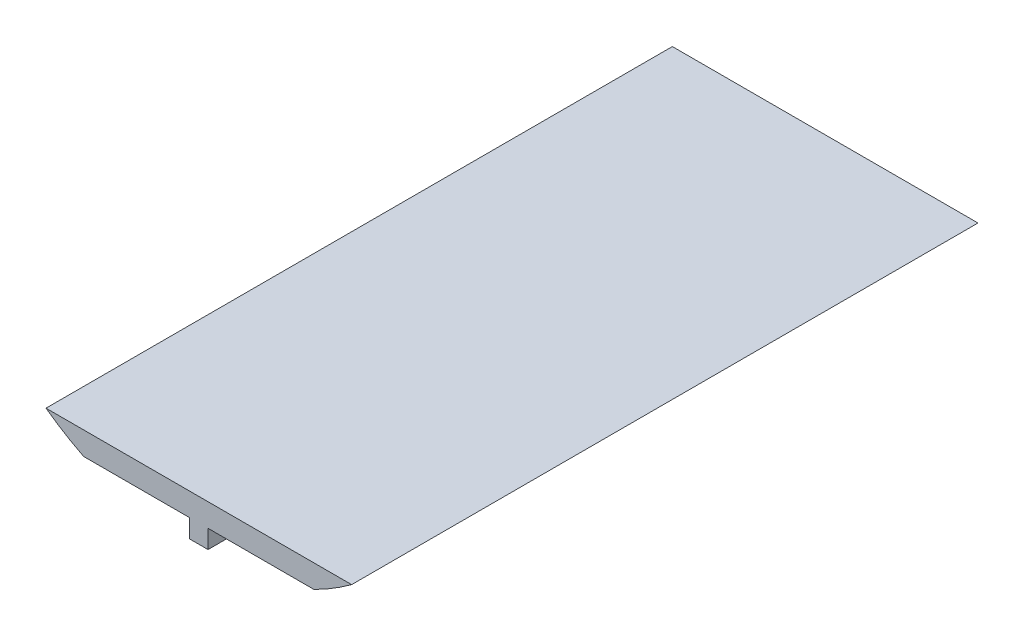
ISO-10303-21;
HEADER;
FILE_DESCRIPTION(('STEP AP214'),'2;1');
FILE_NAME('part.step','',(''),(''),'','','');
FILE_SCHEMA(('AUTOMOTIVE_DESIGN { 1 0 10303 214 1 1 1 1 }'));
ENDSEC;
DATA;
#1=APPLICATION_CONTEXT('core data for automotive mechanical design processes');
#2=APPLICATION_PROTOCOL_DEFINITION('international standard','automotive_design',2000,#1);
#3=PRODUCT_CONTEXT('',#1,'mechanical');
#4=PRODUCT('Part','Part','',(#3));
#5=PRODUCT_RELATED_PRODUCT_CATEGORY('part','',(#4));
#6=PRODUCT_DEFINITION_FORMATION('','',#4);
#7=PRODUCT_DEFINITION_CONTEXT('part definition',#1,'design');
#8=PRODUCT_DEFINITION('design','',#6,#7);
#9=PRODUCT_DEFINITION_SHAPE('','',#8);
#10=(LENGTH_UNIT() NAMED_UNIT(*) SI_UNIT(.MILLI.,.METRE.));
#11=(NAMED_UNIT(*) PLANE_ANGLE_UNIT() SI_UNIT($,.RADIAN.));
#12=(NAMED_UNIT(*) SI_UNIT($,.STERADIAN.) SOLID_ANGLE_UNIT());
#13=UNCERTAINTY_MEASURE_WITH_UNIT(LENGTH_MEASURE(1.E-05),#10,'distance_accuracy_value','');
#14=(GEOMETRIC_REPRESENTATION_CONTEXT(3) GLOBAL_UNCERTAINTY_ASSIGNED_CONTEXT((#13)) GLOBAL_UNIT_ASSIGNED_CONTEXT((#10,
#11,#12)) REPRESENTATION_CONTEXT('',''));
#15=CARTESIAN_POINT('',(0.,0.,0.));
#16=DIRECTION('',(0.,0.,1.));
#17=DIRECTION('',(1.,0.,0.));
#18=AXIS2_PLACEMENT_3D('',#15,#16,#17);
#19=CARTESIAN_POINT('',(-31.75,-63.6395466671471,0.));
#20=DIRECTION('',(0.,1.,0.));
#21=DIRECTION('',(0.,0.,1.));
#22=AXIS2_PLACEMENT_3D('',#19,#20,#21);
#23=PLANE('',#22);
#24=DIRECTION('',(0.,0.,-1.));
#25=VECTOR('',#24,1.);
#26=CARTESIAN_POINT('',(-2.54,-63.6395466671471,172.72));
#27=LINE('',#26,#25);
#28=CARTESIAN_POINT('',(-2.53999999999999,-63.6395466671471,172.72));
#29=VERTEX_POINT('',#28);
#30=CARTESIAN_POINT('',(-2.53999999999999,-63.6395466671471,0.));
#31=VERTEX_POINT('',#30);
#32=EDGE_CURVE('E126',#29,#31,#27,.T.);
#33=ORIENTED_EDGE('',*,*,#32,.F.);
#34=DIRECTION('',(-1.,0.,0.));
#35=VECTOR('',#34,1.);
#36=CARTESIAN_POINT('',(-31.75,-63.6395466671471,172.72));
#37=LINE('',#36,#35);
#38=CARTESIAN_POINT('',(-31.75,-63.6395466671471,172.72));
#39=VERTEX_POINT('',#38);
#40=EDGE_CURVE('E140',#29,#39,#37,.T.);
#41=ORIENTED_EDGE('',*,*,#40,.T.);
#42=DIRECTION('',(0.,0.,1.));
#43=VECTOR('',#42,1.);
#44=CARTESIAN_POINT('',(-31.75,-63.6395466671471,0.));
#45=LINE('',#44,#43);
#46=CARTESIAN_POINT('',(-31.75,-63.6395466671471,0.));
#47=VERTEX_POINT('',#46);
#48=EDGE_CURVE('E146',#47,#39,#45,.T.);
#49=ORIENTED_EDGE('',*,*,#48,.F.);
#50=DIRECTION('',(-1.,0.,0.));
#51=VECTOR('',#50,1.);
#52=CARTESIAN_POINT('',(-31.75,-63.6395466671471,0.));
#53=LINE('',#52,#51);
#54=EDGE_CURVE('E54',#31,#47,#53,.T.);
#55=ORIENTED_EDGE('',*,*,#54,.F.);
#56=EDGE_LOOP('',(#33,#41,#49,#55));
#57=FACE_BOUND('',#56,.T.);
#58=ADVANCED_FACE('F38',(#57),#23,.F.);
#59=DIRECTION('',(0.,0.,1.));
#60=VECTOR('',#59,1.);
#61=CARTESIAN_POINT('',(2.54,-63.6395466671471,172.72));
#62=LINE('',#61,#60);
#63=CARTESIAN_POINT('',(2.54000000000001,-63.6395466671471,0.));
#64=VERTEX_POINT('',#63);
#65=CARTESIAN_POINT('',(2.54,-63.6395466671471,172.72));
#66=VERTEX_POINT('',#65);
#67=EDGE_CURVE('E62',#64,#66,#62,.T.);
#68=ORIENTED_EDGE('',*,*,#67,.F.);
#69=CARTESIAN_POINT('',(31.75,-63.6395466671471,0.));
#70=VERTEX_POINT('',#69);
#71=EDGE_CURVE('E141',#70,#64,#53,.T.);
#72=ORIENTED_EDGE('',*,*,#71,.F.);
#73=DIRECTION('',(0.,0.,1.));
#74=VECTOR('',#73,1.);
#75=CARTESIAN_POINT('',(31.75,-63.6395466671471,0.));
#76=LINE('',#75,#74);
#77=CARTESIAN_POINT('',(31.75,-63.6395466671471,172.72));
#78=VERTEX_POINT('',#77);
#79=EDGE_CURVE('E143',#70,#78,#76,.T.);
#80=ORIENTED_EDGE('',*,*,#79,.T.);
#81=EDGE_CURVE('E144',#78,#66,#37,.T.);
#82=ORIENTED_EDGE('',*,*,#81,.T.);
#83=EDGE_LOOP('',(#68,#72,#80,#82));
#84=FACE_BOUND('',#83,.T.);
#85=ADVANCED_FACE('F152',(#84),#23,.F.);
#86=CARTESIAN_POINT('',(0.,0.,172.72));
#87=DIRECTION('',(0.,0.,-1.));
#88=DIRECTION('',(-1.,0.,0.));
#89=AXIS2_PLACEMENT_3D('',#86,#87,#88);
#90=CYLINDRICAL_SURFACE('',#89,71.12);
#91=DIRECTION('',(0.,0.,-1.));
#92=VECTOR('',#91,1.);
#93=CARTESIAN_POINT('',(-42.142167038167,-57.2895466671471,172.72));
#94=LINE('',#93,#92);
#95=CARTESIAN_POINT('',(-42.142167038167,-57.2895466671471,0.));
#96=VERTEX_POINT('',#95);
#97=CARTESIAN_POINT('',(-42.142167038167,-57.2895466671471,172.72));
#98=VERTEX_POINT('',#97);
#99=EDGE_CURVE('E138',#96,#98,#94,.F.);
#100=ORIENTED_EDGE('',*,*,#99,.F.);
#101=CARTESIAN_POINT('',(0.,0.,0.));
#102=DIRECTION('',(0.,0.,1.));
#103=DIRECTION('',(1.,0.,0.));
#104=AXIS2_PLACEMENT_3D('',#101,#102,#103);
#105=CIRCLE('',#104,71.12);
#106=EDGE_CURVE('E149',#96,#47,#105,.T.);
#107=ORIENTED_EDGE('',*,*,#106,.T.);
#108=ORIENTED_EDGE('',*,*,#48,.T.);
#109=CARTESIAN_POINT('',(0.,0.,172.72));
#110=DIRECTION('',(0.,0.,1.));
#111=DIRECTION('',(1.,0.,0.));
#112=AXIS2_PLACEMENT_3D('',#109,#110,#111);
#113=CIRCLE('',#112,71.12);
#114=EDGE_CURVE('E47',#98,#39,#113,.T.);
#115=ORIENTED_EDGE('',*,*,#114,.F.);
#116=EDGE_LOOP('',(#100,#107,#108,#115));
#117=FACE_BOUND('',#116,.T.);
#118=ADVANCED_FACE('F40',(#117),#90,.T.);
#119=DIRECTION('',(0.,0.,-1.));
#120=VECTOR('',#119,1.);
#121=CARTESIAN_POINT('',(42.142167038167,-57.2895466671471,172.72));
#122=LINE('',#121,#120);
#123=CARTESIAN_POINT('',(42.142167038167,-57.2895466671471,172.72));
#124=VERTEX_POINT('',#123);
#125=CARTESIAN_POINT('',(42.142167038167,-57.2895466671471,0.));
#126=VERTEX_POINT('',#125);
#127=EDGE_CURVE('E136',#124,#126,#122,.T.);
#128=ORIENTED_EDGE('',*,*,#127,.F.);
#129=EDGE_CURVE('E11',#78,#124,#113,.T.);
#130=ORIENTED_EDGE('',*,*,#129,.F.);
#131=ORIENTED_EDGE('',*,*,#79,.F.);
#132=EDGE_CURVE('E42',#70,#126,#105,.T.);
#133=ORIENTED_EDGE('',*,*,#132,.T.);
#134=EDGE_LOOP('',(#128,#130,#131,#133));
#135=FACE_BOUND('',#134,.T.);
#136=ADVANCED_FACE('F163',(#135),#90,.T.);
#137=CARTESIAN_POINT('',(0.,0.,172.72));
#138=DIRECTION('',(0.,0.,1.));
#139=DIRECTION('',(1.,0.,0.));
#140=AXIS2_PLACEMENT_3D('',#137,#138,#139);
#141=PLANE('',#140);
#142=ORIENTED_EDGE('',*,*,#129,.T.);
#143=DIRECTION('',(1.,0.,0.));
#144=VECTOR('',#143,1.);
#145=CARTESIAN_POINT('',(-66.3760947633755,-57.2895466671471,172.72));
#146=LINE('',#145,#144);
#147=EDGE_CURVE('E127',#98,#124,#146,.T.);
#148=ORIENTED_EDGE('',*,*,#147,.F.);
#149=ORIENTED_EDGE('',*,*,#114,.T.);
#150=ORIENTED_EDGE('',*,*,#40,.F.);
#151=DIRECTION('',(0.,1.,0.));
#152=VECTOR('',#151,1.);
#153=CARTESIAN_POINT('',(-2.54,-68.7195466671471,172.72));
#154=LINE('',#153,#152);
#155=CARTESIAN_POINT('',(-2.54,-68.7195466671471,172.72));
#156=VERTEX_POINT('',#155);
#157=EDGE_CURVE('E178',#156,#29,#154,.T.);
#158=ORIENTED_EDGE('',*,*,#157,.F.);
#159=DIRECTION('',(-1.,0.,0.));
#160=VECTOR('',#159,1.);
#161=CARTESIAN_POINT('',(-2.54,-68.7195466671471,172.72));
#162=LINE('',#161,#160);
#163=CARTESIAN_POINT('',(2.54,-68.7195466671471,172.72));
#164=VERTEX_POINT('',#163);
#165=EDGE_CURVE('E120',#164,#156,#162,.T.);
#166=ORIENTED_EDGE('',*,*,#165,.F.);
#167=DIRECTION('',(0.,1.,0.));
#168=VECTOR('',#167,1.);
#169=CARTESIAN_POINT('',(2.54,-68.7195466671471,172.72));
#170=LINE('',#169,#168);
#171=EDGE_CURVE('E131',#164,#66,#170,.T.);
#172=ORIENTED_EDGE('',*,*,#171,.T.);
#173=ORIENTED_EDGE('',*,*,#81,.F.);
#174=EDGE_LOOP('',(#142,#148,#149,#150,#158,#166,#172,#173));
#175=FACE_BOUND('',#174,.T.);
#176=ADVANCED_FACE('F159',(#175),#141,.T.);
#177=CARTESIAN_POINT('',(0.,0.,0.));
#178=DIRECTION('',(0.,0.,1.));
#179=DIRECTION('',(1.,0.,0.));
#180=AXIS2_PLACEMENT_3D('',#177,#178,#179);
#181=PLANE('',#180);
#182=DIRECTION('',(-1.,0.,0.));
#183=VECTOR('',#182,1.);
#184=CARTESIAN_POINT('',(-66.3760947633755,-57.2895466671471,0.));
#185=LINE('',#184,#183);
#186=EDGE_CURVE('E129',#126,#96,#185,.T.);
#187=ORIENTED_EDGE('',*,*,#186,.F.);
#188=ORIENTED_EDGE('',*,*,#132,.F.);
#189=ORIENTED_EDGE('',*,*,#71,.T.);
#190=DIRECTION('',(0.,1.,0.));
#191=VECTOR('',#190,1.);
#192=CARTESIAN_POINT('',(2.54000000000003,-68.7195466671471,0.));
#193=LINE('',#192,#191);
#194=CARTESIAN_POINT('',(2.54000000000003,-68.7195466671471,0.));
#195=VERTEX_POINT('',#194);
#196=EDGE_CURVE('E111',#195,#64,#193,.T.);
#197=ORIENTED_EDGE('',*,*,#196,.F.);
#198=DIRECTION('',(1.,0.,0.));
#199=VECTOR('',#198,1.);
#200=CARTESIAN_POINT('',(-2.53999999999997,-68.7195466671471,0.));
#201=LINE('',#200,#199);
#202=CARTESIAN_POINT('',(-2.53999999999997,-68.7195466671471,0.));
#203=VERTEX_POINT('',#202);
#204=EDGE_CURVE('E103',#203,#195,#201,.T.);
#205=ORIENTED_EDGE('',*,*,#204,.F.);
#206=DIRECTION('',(0.,1.,0.));
#207=VECTOR('',#206,1.);
#208=CARTESIAN_POINT('',(-2.53999999999997,-68.7195466671471,0.));
#209=LINE('',#208,#207);
#210=EDGE_CURVE('E108',#203,#31,#209,.T.);
#211=ORIENTED_EDGE('',*,*,#210,.T.);
#212=ORIENTED_EDGE('',*,*,#54,.T.);
#213=ORIENTED_EDGE('',*,*,#106,.F.);
#214=EDGE_LOOP('',(#187,#188,#189,#197,#205,#211,#212,#213));
#215=FACE_BOUND('',#214,.T.);
#216=ADVANCED_FACE('F106',(#215),#181,.F.);
#217=CARTESIAN_POINT('',(0.,-57.2895466671471,0.));
#218=DIRECTION('',(0.,1.,0.));
#219=DIRECTION('',(0.,0.,1.));
#220=AXIS2_PLACEMENT_3D('',#217,#218,#219);
#221=PLANE('',#220);
#222=ORIENTED_EDGE('',*,*,#99,.T.);
#223=ORIENTED_EDGE('',*,*,#147,.T.);
#224=ORIENTED_EDGE('',*,*,#127,.T.);
#225=ORIENTED_EDGE('',*,*,#186,.T.);
#226=EDGE_LOOP('',(#222,#223,#224,#225));
#227=FACE_BOUND('',#226,.T.);
#228=ADVANCED_FACE('F165',(#227),#221,.T.);
#229=CARTESIAN_POINT('',(-2.54,-68.7195466671471,172.72));
#230=DIRECTION('',(1.,0.,0.));
#231=DIRECTION('',(0.,0.,-1.));
#232=AXIS2_PLACEMENT_3D('',#229,#230,#231);
#233=PLANE('',#232);
#234=ORIENTED_EDGE('',*,*,#32,.T.);
#235=ORIENTED_EDGE('',*,*,#210,.F.);
#236=DIRECTION('',(0.,0.,-1.));
#237=VECTOR('',#236,1.);
#238=CARTESIAN_POINT('',(-2.54,-68.7195466671471,172.72));
#239=LINE('',#238,#237);
#240=EDGE_CURVE('E115',#156,#203,#239,.T.);
#241=ORIENTED_EDGE('',*,*,#240,.F.);
#242=ORIENTED_EDGE('',*,*,#157,.T.);
#243=EDGE_LOOP('',(#234,#235,#241,#242));
#244=FACE_BOUND('',#243,.T.);
#245=ADVANCED_FACE('F125',(#244),#233,.F.);
#246=CARTESIAN_POINT('',(2.54,-68.7195466671471,172.72));
#247=DIRECTION('',(-1.,0.,0.));
#248=DIRECTION('',(0.,0.,1.));
#249=AXIS2_PLACEMENT_3D('',#246,#247,#248);
#250=PLANE('',#249);
#251=ORIENTED_EDGE('',*,*,#67,.T.);
#252=ORIENTED_EDGE('',*,*,#171,.F.);
#253=DIRECTION('',(0.,0.,1.));
#254=VECTOR('',#253,1.);
#255=CARTESIAN_POINT('',(2.54,-68.7195466671471,172.72));
#256=LINE('',#255,#254);
#257=EDGE_CURVE('E114',#195,#164,#256,.T.);
#258=ORIENTED_EDGE('',*,*,#257,.F.);
#259=ORIENTED_EDGE('',*,*,#196,.T.);
#260=EDGE_LOOP('',(#251,#252,#258,#259));
#261=FACE_BOUND('',#260,.T.);
#262=ADVANCED_FACE('F180',(#261),#250,.F.);
#263=CARTESIAN_POINT('',(0.,-68.7195466671471,0.));
#264=DIRECTION('',(0.,-1.,0.));
#265=DIRECTION('',(0.,0.,-1.));
#266=AXIS2_PLACEMENT_3D('',#263,#264,#265);
#267=PLANE('',#266);
#268=ORIENTED_EDGE('',*,*,#240,.T.);
#269=ORIENTED_EDGE('',*,*,#204,.T.);
#270=ORIENTED_EDGE('',*,*,#257,.T.);
#271=ORIENTED_EDGE('',*,*,#165,.T.);
#272=EDGE_LOOP('',(#268,#269,#270,#271));
#273=FACE_BOUND('',#272,.T.);
#274=ADVANCED_FACE('F118',(#273),#267,.T.);
#275=CLOSED_SHELL('',(#58,#85,#118,#136,#176,#216,#228,#245,#262,#274));
#276=MANIFOLD_SOLID_BREP('B2',#275);
#277=ADVANCED_BREP_SHAPE_REPRESENTATION('',(#18,#276),#14);
#278=SHAPE_DEFINITION_REPRESENTATION(#9,#277);
ENDSEC;
END-ISO-10303-21;
